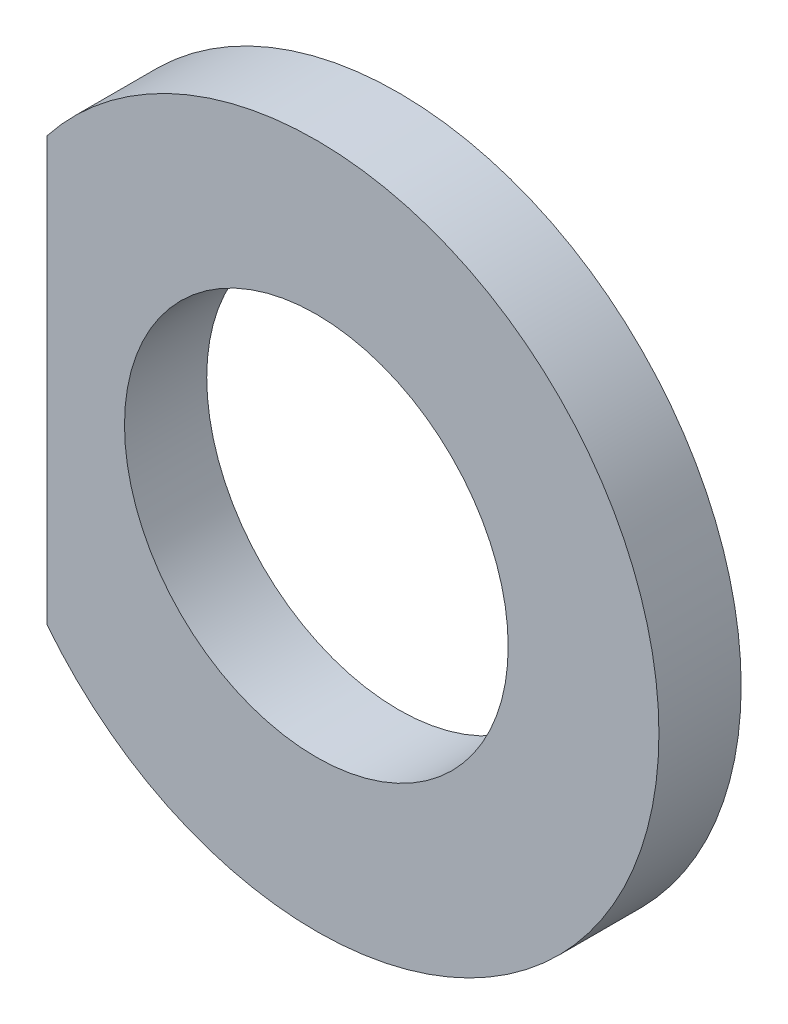
ISO-10303-21;
HEADER;
FILE_DESCRIPTION(('STEP AP214'),'2;1');
FILE_NAME('part.step','',(''),(''),'','','');
FILE_SCHEMA(('AUTOMOTIVE_DESIGN { 1 0 10303 214 1 1 1 1 }'));
ENDSEC;
DATA;
#1=APPLICATION_CONTEXT('core data for automotive mechanical design processes');
#2=APPLICATION_PROTOCOL_DEFINITION('international standard','automotive_design',2000,#1);
#3=PRODUCT_CONTEXT('',#1,'mechanical');
#4=PRODUCT('Part','Part','',(#3));
#5=PRODUCT_RELATED_PRODUCT_CATEGORY('part','',(#4));
#6=PRODUCT_DEFINITION_FORMATION('','',#4);
#7=PRODUCT_DEFINITION_CONTEXT('part definition',#1,'design');
#8=PRODUCT_DEFINITION('design','',#6,#7);
#9=PRODUCT_DEFINITION_SHAPE('','',#8);
#10=(LENGTH_UNIT() NAMED_UNIT(*) SI_UNIT(.MILLI.,.METRE.));
#11=(NAMED_UNIT(*) PLANE_ANGLE_UNIT() SI_UNIT($,.RADIAN.));
#12=(NAMED_UNIT(*) SI_UNIT($,.STERADIAN.) SOLID_ANGLE_UNIT());
#13=UNCERTAINTY_MEASURE_WITH_UNIT(LENGTH_MEASURE(1.E-05),#10,'distance_accuracy_value','');
#14=(GEOMETRIC_REPRESENTATION_CONTEXT(3) GLOBAL_UNCERTAINTY_ASSIGNED_CONTEXT((#13)) GLOBAL_UNIT_ASSIGNED_CONTEXT((#10,
#11,#12)) REPRESENTATION_CONTEXT('',''));
#15=CARTESIAN_POINT('',(0.,0.,0.));
#16=DIRECTION('',(0.,0.,1.));
#17=DIRECTION('',(1.,0.,0.));
#18=AXIS2_PLACEMENT_3D('',#15,#16,#17);
#19=CARTESIAN_POINT('',(0.,0.,-1.8));
#20=DIRECTION('',(0.,0.,1.));
#21=DIRECTION('',(1.,0.,0.));
#22=AXIS2_PLACEMENT_3D('',#19,#20,#21);
#23=CYLINDRICAL_SURFACE('',#22,7.5);
#24=CARTESIAN_POINT('',(0.,0.,0.));
#25=DIRECTION('',(0.,0.,1.));
#26=DIRECTION('',(1.,0.,0.));
#27=AXIS2_PLACEMENT_3D('',#24,#25,#26);
#28=CIRCLE('',#27,7.5);
#29=CARTESIAN_POINT('',(-5.9,-4.63033476111609,0.));
#30=VERTEX_POINT('',#29);
#31=CARTESIAN_POINT('',(-5.9,4.63033476111609,0.));
#32=VERTEX_POINT('',#31);
#33=EDGE_CURVE('E61',#30,#32,#28,.T.);
#34=ORIENTED_EDGE('',*,*,#33,.F.);
#35=DIRECTION('',(0.,0.,1.));
#36=VECTOR('',#35,1.);
#37=CARTESIAN_POINT('',(-5.9,-4.63033476111609,-1.8));
#38=LINE('',#37,#36);
#39=CARTESIAN_POINT('',(-5.9,-4.63033476111609,-1.8));
#40=VERTEX_POINT('',#39);
#41=EDGE_CURVE('E11',#40,#30,#38,.T.);
#42=ORIENTED_EDGE('',*,*,#41,.F.);
#43=CARTESIAN_POINT('',(0.,0.,-1.8));
#44=DIRECTION('',(0.,0.,1.));
#45=DIRECTION('',(1.,0.,0.));
#46=AXIS2_PLACEMENT_3D('',#43,#44,#45);
#47=CIRCLE('',#46,7.5);
#48=CARTESIAN_POINT('',(-5.9,4.63033476111609,-1.8));
#49=VERTEX_POINT('',#48);
#50=EDGE_CURVE('E66',#40,#49,#47,.T.);
#51=ORIENTED_EDGE('',*,*,#50,.T.);
#52=DIRECTION('',(0.,0.,1.));
#53=VECTOR('',#52,1.);
#54=CARTESIAN_POINT('',(-5.9,4.63033476111609,-1.8));
#55=LINE('',#54,#53);
#56=EDGE_CURVE('E35',#49,#32,#55,.T.);
#57=ORIENTED_EDGE('',*,*,#56,.T.);
#58=EDGE_LOOP('',(#34,#42,#51,#57));
#59=FACE_BOUND('',#58,.T.);
#60=ADVANCED_FACE('F32',(#59),#23,.T.);
#61=CARTESIAN_POINT('',(-5.9,4.63033476111609,-1.8));
#62=DIRECTION('',(-1.,0.,0.));
#63=DIRECTION('',(0.,0.,1.));
#64=AXIS2_PLACEMENT_3D('',#61,#62,#63);
#65=PLANE('',#64);
#66=DIRECTION('',(0.,-1.,0.));
#67=VECTOR('',#66,1.);
#68=CARTESIAN_POINT('',(-5.9,4.63033476111609,0.));
#69=LINE('',#68,#67);
#70=EDGE_CURVE('E58',#32,#30,#69,.T.);
#71=ORIENTED_EDGE('',*,*,#70,.F.);
#72=ORIENTED_EDGE('',*,*,#56,.F.);
#73=DIRECTION('',(0.,-1.,0.));
#74=VECTOR('',#73,1.);
#75=CARTESIAN_POINT('',(-5.9,4.63033476111609,-1.8));
#76=LINE('',#75,#74);
#77=EDGE_CURVE('E60',#49,#40,#76,.T.);
#78=ORIENTED_EDGE('',*,*,#77,.T.);
#79=ORIENTED_EDGE('',*,*,#41,.T.);
#80=EDGE_LOOP('',(#71,#72,#78,#79));
#81=FACE_BOUND('',#80,.T.);
#82=ADVANCED_FACE('F56',(#81),#65,.T.);
#83=CARTESIAN_POINT('',(0.,0.,-1.8));
#84=DIRECTION('',(0.,0.,1.));
#85=DIRECTION('',(1.,0.,0.));
#86=AXIS2_PLACEMENT_3D('',#83,#84,#85);
#87=PLANE('',#86);
#88=CARTESIAN_POINT('',(0.,0.,-1.8));
#89=DIRECTION('',(0.,0.,1.));
#90=DIRECTION('',(1.,0.,0.));
#91=AXIS2_PLACEMENT_3D('',#88,#89,#90);
#92=CIRCLE('',#91,4.2);
#93=CARTESIAN_POINT('',(4.2,0.,-1.8));
#94=VERTEX_POINT('',#93);
#95=EDGE_CURVE('E63',#94,#94,#92,.T.);
#96=ORIENTED_EDGE('',*,*,#95,.T.);
#97=EDGE_LOOP('',(#96));
#98=FACE_BOUND('',#97,.T.);
#99=ORIENTED_EDGE('',*,*,#50,.F.);
#100=ORIENTED_EDGE('',*,*,#77,.F.);
#101=EDGE_LOOP('',(#99,#100));
#102=FACE_BOUND('',#101,.T.);
#103=ADVANCED_FACE('F77',(#98,#102),#87,.F.);
#104=CARTESIAN_POINT('',(0.,0.,0.));
#105=DIRECTION('',(0.,0.,1.));
#106=DIRECTION('',(1.,0.,0.));
#107=AXIS2_PLACEMENT_3D('',#104,#105,#106);
#108=PLANE('',#107);
#109=CARTESIAN_POINT('',(0.,0.,0.));
#110=DIRECTION('',(0.,0.,1.));
#111=DIRECTION('',(1.,0.,0.));
#112=AXIS2_PLACEMENT_3D('',#109,#110,#111);
#113=CIRCLE('',#112,4.2);
#114=CARTESIAN_POINT('',(4.2,0.,0.));
#115=VERTEX_POINT('',#114);
#116=EDGE_CURVE('E71',#115,#115,#113,.T.);
#117=ORIENTED_EDGE('',*,*,#116,.F.);
#118=EDGE_LOOP('',(#117));
#119=FACE_BOUND('',#118,.T.);
#120=ORIENTED_EDGE('',*,*,#33,.T.);
#121=ORIENTED_EDGE('',*,*,#70,.T.);
#122=EDGE_LOOP('',(#120,#121));
#123=FACE_BOUND('',#122,.T.);
#124=ADVANCED_FACE('F65',(#119,#123),#108,.T.);
#125=CARTESIAN_POINT('',(0.,0.,-1.8));
#126=DIRECTION('',(0.,0.,1.));
#127=DIRECTION('',(1.,0.,0.));
#128=AXIS2_PLACEMENT_3D('',#125,#126,#127);
#129=CYLINDRICAL_SURFACE('',#128,4.2);
#130=ORIENTED_EDGE('',*,*,#95,.F.);
#131=EDGE_LOOP('',(#130));
#132=FACE_BOUND('',#131,.T.);
#133=ORIENTED_EDGE('',*,*,#116,.T.);
#134=EDGE_LOOP('',(#133));
#135=FACE_BOUND('',#134,.T.);
#136=ADVANCED_FACE('F80',(#132,#135),#129,.F.);
#137=CLOSED_SHELL('',(#60,#82,#103,#124,#136));
#138=MANIFOLD_SOLID_BREP('B2',#137);
#139=ADVANCED_BREP_SHAPE_REPRESENTATION('',(#18,#138),#14);
#140=SHAPE_DEFINITION_REPRESENTATION(#9,#139);
ENDSEC;
END-ISO-10303-21;
